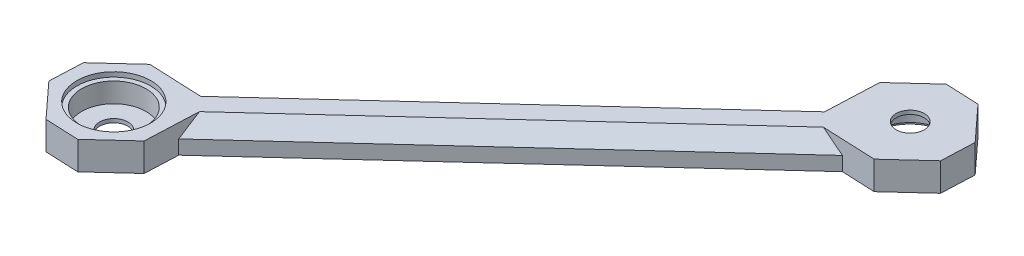
ISO-10303-21;
HEADER;
FILE_DESCRIPTION(('STEP AP214'),'2;1');
FILE_NAME('part.step','',(''),(''),'','','');
FILE_SCHEMA(('AUTOMOTIVE_DESIGN { 1 0 10303 214 1 1 1 1 }'));
ENDSEC;
DATA;
#1=APPLICATION_CONTEXT('core data for automotive mechanical design processes');
#2=APPLICATION_PROTOCOL_DEFINITION('international standard','automotive_design',2000,#1);
#3=PRODUCT_CONTEXT('',#1,'mechanical');
#4=PRODUCT('Part','Part','',(#3));
#5=PRODUCT_RELATED_PRODUCT_CATEGORY('part','',(#4));
#6=PRODUCT_DEFINITION_FORMATION('','',#4);
#7=PRODUCT_DEFINITION_CONTEXT('part definition',#1,'design');
#8=PRODUCT_DEFINITION('design','',#6,#7);
#9=PRODUCT_DEFINITION_SHAPE('','',#8);
#10=(LENGTH_UNIT() NAMED_UNIT(*) SI_UNIT(.MILLI.,.METRE.));
#11=(NAMED_UNIT(*) PLANE_ANGLE_UNIT() SI_UNIT($,.RADIAN.));
#12=(NAMED_UNIT(*) SI_UNIT($,.STERADIAN.) SOLID_ANGLE_UNIT());
#13=UNCERTAINTY_MEASURE_WITH_UNIT(LENGTH_MEASURE(1.E-05),#10,'distance_accuracy_value','');
#14=(GEOMETRIC_REPRESENTATION_CONTEXT(3) GLOBAL_UNCERTAINTY_ASSIGNED_CONTEXT((#13)) GLOBAL_UNIT_ASSIGNED_CONTEXT((#10,
#11,#12)) REPRESENTATION_CONTEXT('',''));
#15=CARTESIAN_POINT('',(0.,0.,0.));
#16=DIRECTION('',(0.,0.,1.));
#17=DIRECTION('',(1.,0.,0.));
#18=AXIS2_PLACEMENT_3D('',#15,#16,#17);
#19=CARTESIAN_POINT('',(348.939297813,-49.500004703,3.286550576));
#20=DIRECTION('',(0.,1.,0.));
#21=DIRECTION('',(1.,0.,0.));
#22=AXIS2_PLACEMENT_3D('',#19,#20,#21);
#23=PLANE('',#22);
#24=CARTESIAN_POINT('',(64.048276533,-49.500004703,44.965154128));
#25=DIRECTION('',(0.,1.,0.));
#26=DIRECTION('',(-1.,0.,0.));
#27=AXIS2_PLACEMENT_3D('',#24,#25,#26);
#28=CIRCLE('',#27,7.85);
#29=CARTESIAN_POINT('',(56.198276533,-49.500004703,44.965154128));
#30=VERTEX_POINT('',#29);
#31=CARTESIAN_POINT('',(65.680383306,-49.500004703,37.286695462));
#32=VERTEX_POINT('',#31);
#33=EDGE_CURVE('E349',#30,#32,#28,.T.);
#34=ORIENTED_EDGE('',*,*,#33,.T.);
#35=CARTESIAN_POINT('',(64.048276533,-49.500004703,44.965154128));
#36=DIRECTION('',(0.,1.,0.));
#37=DIRECTION('',(-1.,0.,0.));
#38=AXIS2_PLACEMENT_3D('',#35,#36,#37);
#39=CIRCLE('',#38,7.85);
#40=EDGE_CURVE('E322',#32,#30,#39,.T.);
#41=ORIENTED_EDGE('',*,*,#40,.T.);
#42=EDGE_LOOP('',(#34,#41));
#43=FACE_BOUND('',#42,.T.);
#44=DIRECTION('',(-0.675992147281027,0.,-0.736908825306351));
#45=VECTOR('',#44,1.);
#46=CARTESIAN_POINT('',(-28.369910029,-49.500004703,136.528677393));
#47=LINE('',#46,#45);
#48=CARTESIAN_POINT('',(-28.369910029,-49.500004703,136.528677393));
#49=VERTEX_POINT('',#48);
#50=CARTESIAN_POINT('',(-35.129831501,-49.500004703,129.159589139));
#51=VERTEX_POINT('',#50);
#52=EDGE_CURVE('E403',#49,#51,#47,.T.);
#53=ORIENTED_EDGE('',*,*,#52,.T.);
#54=DIRECTION('',(-0.0430745959942651,0.,0.999071858866984));
#55=VECTOR('',#54,1.);
#56=CARTESIAN_POINT('',(-34.82524811,-49.500004703,122.095084277));
#57=LINE('',#56,#55);
#58=CARTESIAN_POINT('',(-34.82524811,-49.500004703,122.095084277));
#59=VERTEX_POINT('',#58);
#60=EDGE_CURVE('E318',#59,#51,#57,.T.);
#61=ORIENTED_EDGE('',*,*,#60,.F.);
#62=DIRECTION('',(0.736908825306351,0.,-0.675992147281027));
#63=VECTOR('',#62,1.);
#64=CARTESIAN_POINT('',(-34.82524811,-49.500004703,122.095084277));
#65=LINE('',#64,#63);
#66=CARTESIAN_POINT('',(-27.456159857,-49.500004703,115.335162804));
#67=VERTEX_POINT('',#66);
#68=EDGE_CURVE('E278',#59,#67,#65,.T.);
#69=ORIENTED_EDGE('',*,*,#68,.T.);
#70=DIRECTION('',(-0.999071858866984,0.,-0.0430745959942651));
#71=VECTOR('',#70,1.);
#72=CARTESIAN_POINT('',(-20.391654994,-49.500004703,115.639746195));
#73=LINE('',#72,#71);
#74=CARTESIAN_POINT('',(-20.391654994,-49.500004703,115.639746195));
#75=VERTEX_POINT('',#74);
#76=EDGE_CURVE('E298',#75,#67,#73,.T.);
#77=ORIENTED_EDGE('',*,*,#76,.F.);
#78=DIRECTION('',(0.736908825306351,0.,-0.675992147281027));
#79=VECTOR('',#78,1.);
#80=CARTESIAN_POINT('',(-20.391654994,-49.500004703,115.639746195));
#81=LINE('',#80,#79);
#82=CARTESIAN_POINT('',(53.299227543,-49.500004703,48.040531474));
#83=VERTEX_POINT('',#82);
#84=EDGE_CURVE('E453',#75,#83,#81,.T.);
#85=ORIENTED_EDGE('',*,*,#84,.T.);
#86=DIRECTION('',(-0.0430745959942651,0.,0.999071858866984));
#87=VECTOR('',#86,1.);
#88=CARTESIAN_POINT('',(53.603810934,-49.500004703,40.976026611));
#89=LINE('',#88,#87);
#90=CARTESIAN_POINT('',(53.603810934,-49.500004703,40.976026611));
#91=VERTEX_POINT('',#90);
#92=EDGE_CURVE('E398',#91,#83,#89,.T.);
#93=ORIENTED_EDGE('',*,*,#92,.F.);
#94=DIRECTION('',(0.736908825306351,0.,-0.675992147281027));
#95=VECTOR('',#94,1.);
#96=CARTESIAN_POINT('',(53.603810934,-49.500004703,40.976026611));
#97=LINE('',#96,#95);
#98=CARTESIAN_POINT('',(60.972899187,-49.500004703,34.216105138));
#99=VERTEX_POINT('',#98);
#100=EDGE_CURVE('E363',#91,#99,#97,.T.);
#101=ORIENTED_EDGE('',*,*,#100,.T.);
#102=DIRECTION('',(-0.999071858866984,0.,-0.0430745959942651));
#103=VECTOR('',#102,1.);
#104=CARTESIAN_POINT('',(68.03740405,-49.500004703,34.520688529));
#105=LINE('',#104,#103);
#106=CARTESIAN_POINT('',(68.03740405,-49.500004703,34.520688529));
#107=VERTEX_POINT('',#106);
#108=EDGE_CURVE('E375',#107,#99,#105,.T.);
#109=ORIENTED_EDGE('',*,*,#108,.F.);
#110=DIRECTION('',(0.675992147281027,0.,0.736908825306351));
#111=VECTOR('',#110,1.);
#112=CARTESIAN_POINT('',(68.03740405,-49.500004703,34.520688529));
#113=LINE('',#112,#111);
#114=CARTESIAN_POINT('',(74.797325522,-49.500004703,41.889776783));
#115=VERTEX_POINT('',#114);
#116=EDGE_CURVE('E374',#107,#115,#113,.T.);
#117=ORIENTED_EDGE('',*,*,#116,.T.);
#118=DIRECTION('',(-0.0430745959942651,0.,0.999071858866984));
#119=VECTOR('',#118,1.);
#120=CARTESIAN_POINT('',(74.797325522,-49.500004703,41.889776783));
#121=LINE('',#120,#119);
#122=CARTESIAN_POINT('',(74.492742132,-49.500004703,48.954281646));
#123=VERTEX_POINT('',#122);
#124=EDGE_CURVE('E373',#115,#123,#121,.T.);
#125=ORIENTED_EDGE('',*,*,#124,.T.);
#126=DIRECTION('',(-0.736908825306351,0.,0.675992147281027));
#127=VECTOR('',#126,1.);
#128=CARTESIAN_POINT('',(74.492742132,-49.500004703,48.954281646));
#129=LINE('',#128,#127);
#130=CARTESIAN_POINT('',(67.123653878,-49.500004703,55.714203118));
#131=VERTEX_POINT('',#130);
#132=EDGE_CURVE('E422',#123,#131,#129,.T.);
#133=ORIENTED_EDGE('',*,*,#132,.T.);
#134=DIRECTION('',(-0.999071858866984,0.,-0.0430745959942651));
#135=VECTOR('',#134,1.);
#136=CARTESIAN_POINT('',(67.123653878,-49.500004703,55.714203118));
#137=LINE('',#136,#135);
#138=CARTESIAN_POINT('',(60.059149015,-49.500004703,55.409619727));
#139=VERTEX_POINT('',#138);
#140=EDGE_CURVE('E323',#131,#139,#137,.T.);
#141=ORIENTED_EDGE('',*,*,#140,.T.);
#142=DIRECTION('',(0.736908825306351,0.,-0.675992147281027));
#143=VECTOR('',#142,1.);
#144=CARTESIAN_POINT('',(-13.631733522,-49.500004703,123.008834449));
#145=LINE('',#144,#143);
#146=CARTESIAN_POINT('',(-13.631733522,-49.500004703,123.008834449));
#147=VERTEX_POINT('',#146);
#148=EDGE_CURVE('E305',#147,#139,#145,.T.);
#149=ORIENTED_EDGE('',*,*,#148,.F.);
#150=DIRECTION('',(-0.0430745959942651,0.,0.999071858866984));
#151=VECTOR('',#150,1.);
#152=CARTESIAN_POINT('',(-13.631733522,-49.500004703,123.008834449));
#153=LINE('',#152,#151);
#154=CARTESIAN_POINT('',(-13.936316912,-49.500004703,130.073339312));
#155=VERTEX_POINT('',#154);
#156=EDGE_CURVE('E300',#147,#155,#153,.T.);
#157=ORIENTED_EDGE('',*,*,#156,.T.);
#158=DIRECTION('',(0.736908825306351,0.,-0.675992147281027));
#159=VECTOR('',#158,1.);
#160=CARTESIAN_POINT('',(-21.305405166,-49.500004703,136.833260784));
#161=LINE('',#160,#159);
#162=CARTESIAN_POINT('',(-21.305405166,-49.500004703,136.833260784));
#163=VERTEX_POINT('',#162);
#164=EDGE_CURVE('E414',#163,#155,#161,.T.);
#165=ORIENTED_EDGE('',*,*,#164,.F.);
#166=DIRECTION('',(0.999071858866984,0.,0.0430745959942651));
#167=VECTOR('',#166,1.);
#168=CARTESIAN_POINT('',(-28.369910029,-49.500004703,136.528677393));
#169=LINE('',#168,#167);
#170=EDGE_CURVE('E404',#49,#163,#169,.T.);
#171=ORIENTED_EDGE('',*,*,#170,.F.);
#172=EDGE_LOOP('',(#53,#61,#69,#77,#85,#93,#101,#109,#117,#125,#133,#141,#149,#157,#165,#171));
#173=FACE_BOUND('',#172,.T.);
#174=CARTESIAN_POINT('',(-24.380782511,-49.500004703,126.084211794));
#175=DIRECTION('',(0.,1.,0.));
#176=DIRECTION('',(-0.207911690937987,0.,0.97814760070825));
#177=AXIS2_PLACEMENT_3D('',#174,#175,#176);
#178=CIRCLE('',#177,3.);
#179=CARTESIAN_POINT('',(-25.004517584,-49.500004703,129.018654596));
#180=VERTEX_POINT('',#179);
#181=CARTESIAN_POINT('',(-23.757047439,-49.500004703,123.149768992));
#182=VERTEX_POINT('',#181);
#183=EDGE_CURVE('E27',#180,#182,#178,.T.);
#184=ORIENTED_EDGE('',*,*,#183,.T.);
#185=CARTESIAN_POINT('',(-24.380782511,-49.500004703,126.084211794));
#186=DIRECTION('',(0.,1.,0.));
#187=DIRECTION('',(-0.207911690937987,0.,0.97814760070825));
#188=AXIS2_PLACEMENT_3D('',#185,#186,#187);
#189=CIRCLE('',#188,3.);
#190=EDGE_CURVE('E11',#182,#180,#189,.T.);
#191=ORIENTED_EDGE('',*,*,#190,.T.);
#192=EDGE_LOOP('',(#184,#191));
#193=FACE_BOUND('',#192,.T.);
#194=ADVANCED_FACE('F16',(#43,#173,#193),#23,.F.);
#195=CARTESIAN_POINT('',(-24.380782511,-47.500004703,126.084211794));
#196=DIRECTION('',(0.,-1.,0.));
#197=DIRECTION('',(0.207911690937987,0.,-0.97814760070825));
#198=AXIS2_PLACEMENT_3D('',#195,#196,#197);
#199=CYLINDRICAL_SURFACE('',#198,3.);
#200=DIRECTION('',(0.,1.,0.));
#201=VECTOR('',#200,1.);
#202=CARTESIAN_POINT('',(-23.757047439,-49.500004703,123.149768992));
#203=LINE('',#202,#201);
#204=CARTESIAN_POINT('',(-23.757047439,-48.700004703,123.149768992));
#205=VERTEX_POINT('',#204);
#206=EDGE_CURVE('E310',#182,#205,#203,.T.);
#207=ORIENTED_EDGE('',*,*,#206,.F.);
#208=ORIENTED_EDGE('',*,*,#183,.F.);
#209=ORIENTED_EDGE('',*,*,#190,.F.);
#210=ORIENTED_EDGE('',*,*,#206,.T.);
#211=CARTESIAN_POINT('',(-24.380782511,-48.700004703,126.084211794));
#212=DIRECTION('',(0.,1.,0.));
#213=DIRECTION('',(-0.207911690937987,0.,0.97814760070825));
#214=AXIS2_PLACEMENT_3D('',#211,#212,#213);
#215=CIRCLE('',#214,3.);
#216=CARTESIAN_POINT('',(-25.004517584,-48.700004703,129.018654596));
#217=VERTEX_POINT('',#216);
#218=EDGE_CURVE('E311',#205,#217,#215,.T.);
#219=ORIENTED_EDGE('',*,*,#218,.T.);
#220=CARTESIAN_POINT('',(-24.380782511,-48.700004703,126.084211794));
#221=DIRECTION('',(0.,1.,0.));
#222=DIRECTION('',(-0.207911690937987,0.,0.97814760070825));
#223=AXIS2_PLACEMENT_3D('',#220,#221,#222);
#224=CIRCLE('',#223,3.);
#225=EDGE_CURVE('E306',#217,#205,#224,.T.);
#226=ORIENTED_EDGE('',*,*,#225,.T.);
#227=EDGE_LOOP('',(#207,#208,#209,#210,#219,#226));
#228=FACE_BOUND('',#227,.T.);
#229=ADVANCED_FACE('F948',(#228),#199,.F.);
#230=CARTESIAN_POINT('',(260.510238769,-48.700004703,84.405608242));
#231=DIRECTION('',(0.,1.,0.));
#232=DIRECTION('',(1.,0.,0.));
#233=AXIS2_PLACEMENT_3D('',#230,#231,#232);
#234=PLANE('',#233);
#235=CARTESIAN_POINT('',(-24.380782511,-48.700004703,126.084211794));
#236=DIRECTION('',(0.,-1.,0.));
#237=DIRECTION('',(-1.,0.,0.));
#238=AXIS2_PLACEMENT_3D('',#235,#236,#237);
#239=CIRCLE('',#238,6.85);
#240=CARTESIAN_POINT('',(-22.956587429,-48.700004703,119.383900729));
#241=VERTEX_POINT('',#240);
#242=CARTESIAN_POINT('',(-31.230782511,-48.700004703,126.084211794));
#243=VERTEX_POINT('',#242);
#244=EDGE_CURVE('E426',#241,#243,#239,.T.);
#245=ORIENTED_EDGE('',*,*,#244,.F.);
#246=CARTESIAN_POINT('',(-24.380782511,-48.700004703,126.084211794));
#247=DIRECTION('',(0.,-1.,0.));
#248=DIRECTION('',(-1.,0.,0.));
#249=AXIS2_PLACEMENT_3D('',#246,#247,#248);
#250=CIRCLE('',#249,6.85);
#251=EDGE_CURVE('E423',#243,#241,#250,.T.);
#252=ORIENTED_EDGE('',*,*,#251,.F.);
#253=EDGE_LOOP('',(#245,#252));
#254=FACE_BOUND('',#253,.T.);
#255=ORIENTED_EDGE('',*,*,#218,.F.);
#256=ORIENTED_EDGE('',*,*,#225,.F.);
#257=EDGE_LOOP('',(#255,#256));
#258=FACE_BOUND('',#257,.T.);
#259=ADVANCED_FACE('F932',(#254,#258),#234,.T.);
#260=CARTESIAN_POINT('',(-24.380782511,-44.500004703,126.084211794));
#261=DIRECTION('',(0.,-1.,0.));
#262=DIRECTION('',(0.207911690937987,0.,-0.97814760070825));
#263=AXIS2_PLACEMENT_3D('',#260,#261,#262);
#264=CYLINDRICAL_SURFACE('',#263,6.85);
#265=DIRECTION('',(0.,1.,0.));
#266=VECTOR('',#265,1.);
#267=CARTESIAN_POINT('',(-22.956587429,-48.700004703,119.383900729));
#268=LINE('',#267,#266);
#269=CARTESIAN_POINT('',(-22.956587429,-44.500004703,119.383900729));
#270=VERTEX_POINT('',#269);
#271=EDGE_CURVE('E443',#241,#270,#268,.T.);
#272=ORIENTED_EDGE('',*,*,#271,.F.);
#273=ORIENTED_EDGE('',*,*,#244,.T.);
#274=ORIENTED_EDGE('',*,*,#251,.T.);
#275=ORIENTED_EDGE('',*,*,#271,.T.);
#276=CARTESIAN_POINT('',(-24.380782511,-44.500004703,126.084211794));
#277=DIRECTION('',(0.,1.,0.));
#278=DIRECTION('',(-1.,0.,0.));
#279=AXIS2_PLACEMENT_3D('',#276,#277,#278);
#280=CIRCLE('',#279,6.85);
#281=CARTESIAN_POINT('',(-31.230782511,-44.500004703,126.084211794));
#282=VERTEX_POINT('',#281);
#283=EDGE_CURVE('E448',#270,#282,#280,.T.);
#284=ORIENTED_EDGE('',*,*,#283,.T.);
#285=CARTESIAN_POINT('',(-24.380782511,-44.500004703,126.084211794));
#286=DIRECTION('',(0.,1.,0.));
#287=DIRECTION('',(-1.,0.,0.));
#288=AXIS2_PLACEMENT_3D('',#285,#286,#287);
#289=CIRCLE('',#288,6.85);
#290=EDGE_CURVE('E444',#282,#270,#289,.T.);
#291=ORIENTED_EDGE('',*,*,#290,.T.);
#292=EDGE_LOOP('',(#272,#273,#274,#275,#284,#291));
#293=FACE_BOUND('',#292,.T.);
#294=ADVANCED_FACE('F928',(#293),#264,.F.);
#295=CARTESIAN_POINT('',(260.510238769,-44.500004703,84.405608242));
#296=DIRECTION('',(0.,1.,0.));
#297=DIRECTION('',(1.,0.,0.));
#298=AXIS2_PLACEMENT_3D('',#295,#296,#297);
#299=PLANE('',#298);
#300=CARTESIAN_POINT('',(-24.380782511,-44.500004703,126.084211794));
#301=DIRECTION('',(0.,-1.,0.));
#302=DIRECTION('',(-1.,0.,0.));
#303=AXIS2_PLACEMENT_3D('',#300,#301,#302);
#304=CIRCLE('',#303,7.85);
#305=CARTESIAN_POINT('',(-22.748675738,-44.500004703,118.405753128));
#306=VERTEX_POINT('',#305);
#307=CARTESIAN_POINT('',(-32.230782511,-44.500004703,126.084211794));
#308=VERTEX_POINT('',#307);
#309=EDGE_CURVE('E275',#306,#308,#304,.T.);
#310=ORIENTED_EDGE('',*,*,#309,.F.);
#311=CARTESIAN_POINT('',(-24.380782511,-44.500004703,126.084211794));
#312=DIRECTION('',(0.,-1.,0.));
#313=DIRECTION('',(-1.,0.,0.));
#314=AXIS2_PLACEMENT_3D('',#311,#312,#313);
#315=CIRCLE('',#314,7.85);
#316=EDGE_CURVE('E268',#308,#306,#315,.T.);
#317=ORIENTED_EDGE('',*,*,#316,.F.);
#318=EDGE_LOOP('',(#310,#317));
#319=FACE_BOUND('',#318,.T.);
#320=ORIENTED_EDGE('',*,*,#283,.F.);
#321=ORIENTED_EDGE('',*,*,#290,.F.);
#322=EDGE_LOOP('',(#320,#321));
#323=FACE_BOUND('',#322,.T.);
#324=ADVANCED_FACE('F280',(#319,#323),#299,.T.);
#325=CARTESIAN_POINT('',(-33.439851133,-43.500004703,131.001861203));
#326=DIRECTION('',(-0.736908825306351,0.,0.675992147281027));
#327=DIRECTION('',(0.,1.,0.));
#328=AXIS2_PLACEMENT_3D('',#325,#326,#327);
#329=PLANE('',#328);
#330=ORIENTED_EDGE('',*,*,#52,.F.);
#331=DIRECTION('',(0.,-1.,0.));
#332=VECTOR('',#331,1.);
#333=CARTESIAN_POINT('',(-28.369910029,-43.500004703,136.528677393));
#334=LINE('',#333,#332);
#335=CARTESIAN_POINT('',(-28.369910029,-43.500004703,136.528677393));
#336=VERTEX_POINT('',#335);
#337=EDGE_CURVE('E399',#336,#49,#334,.T.);
#338=ORIENTED_EDGE('',*,*,#337,.F.);
#339=DIRECTION('',(-0.675992147281027,0.,-0.736908825306351));
#340=VECTOR('',#339,1.);
#341=CARTESIAN_POINT('',(-28.369910029,-43.500004703,136.528677393));
#342=LINE('',#341,#340);
#343=CARTESIAN_POINT('',(-35.129831501,-43.500004703,129.159589139));
#344=VERTEX_POINT('',#343);
#345=EDGE_CURVE('E408',#336,#344,#342,.T.);
#346=ORIENTED_EDGE('',*,*,#345,.T.);
#347=DIRECTION('',(0.,-1.,0.));
#348=VECTOR('',#347,1.);
#349=CARTESIAN_POINT('',(-35.129831501,-43.500004703,129.159589139));
#350=LINE('',#349,#348);
#351=EDGE_CURVE('E294',#344,#51,#350,.T.);
#352=ORIENTED_EDGE('',*,*,#351,.T.);
#353=EDGE_LOOP('',(#330,#338,#346,#352));
#354=FACE_BOUND('',#353,.T.);
#355=ADVANCED_FACE('F647',(#354),#329,.T.);
#356=CARTESIAN_POINT('',(-24.837657597,-43.500004703,136.680969088));
#357=DIRECTION('',(0.043074595994265,0.,-0.999071858866984));
#358=DIRECTION('',(0.,-1.,0.));
#359=AXIS2_PLACEMENT_3D('',#356,#357,#358);
#360=PLANE('',#359);
#361=ORIENTED_EDGE('',*,*,#170,.T.);
#362=DIRECTION('',(0.,-1.,0.));
#363=VECTOR('',#362,1.);
#364=CARTESIAN_POINT('',(-21.305405166,-43.500004703,136.833260784));
#365=LINE('',#364,#363);
#366=CARTESIAN_POINT('',(-21.305405166,-43.500004703,136.833260784));
#367=VERTEX_POINT('',#366);
#368=EDGE_CURVE('E417',#367,#163,#365,.T.);
#369=ORIENTED_EDGE('',*,*,#368,.F.);
#370=DIRECTION('',(0.999071858866984,0.,0.0430745959942651));
#371=VECTOR('',#370,1.);
#372=CARTESIAN_POINT('',(-28.369910029,-43.500004703,136.528677393));
#373=LINE('',#372,#371);
#374=EDGE_CURVE('E340',#336,#367,#373,.T.);
#375=ORIENTED_EDGE('',*,*,#374,.F.);
#376=ORIENTED_EDGE('',*,*,#337,.T.);
#377=EDGE_LOOP('',(#361,#369,#375,#376));
#378=FACE_BOUND('',#377,.T.);
#379=ADVANCED_FACE('F642',(#378),#360,.F.);
#380=CARTESIAN_POINT('',(16.514885974,-43.500004703,102.139389661));
#381=DIRECTION('',(-0.675992147281027,0.,-0.736908825306351));
#382=DIRECTION('',(-0.736908825306351,0.,0.675992147281027));
#383=AXIS2_PLACEMENT_3D('',#380,#381,#382);
#384=PLANE('',#383);
#385=ORIENTED_EDGE('',*,*,#164,.T.);
#386=DIRECTION('',(0.,-1.,0.));
#387=VECTOR('',#386,1.);
#388=CARTESIAN_POINT('',(-13.936316912,-43.500004703,130.073339312));
#389=LINE('',#388,#387);
#390=CARTESIAN_POINT('',(-13.936316912,-43.500004703,130.073339312));
#391=VERTEX_POINT('',#390);
#392=EDGE_CURVE('E304',#391,#155,#389,.T.);
#393=ORIENTED_EDGE('',*,*,#392,.F.);
#394=DIRECTION('',(0.736908825306351,0.,-0.675992147281027));
#395=VECTOR('',#394,1.);
#396=CARTESIAN_POINT('',(-21.305405166,-43.500004703,136.833260784));
#397=LINE('',#396,#395);
#398=EDGE_CURVE('E335',#367,#391,#397,.T.);
#399=ORIENTED_EDGE('',*,*,#398,.F.);
#400=ORIENTED_EDGE('',*,*,#368,.T.);
#401=EDGE_LOOP('',(#385,#393,#399,#400));
#402=FACE_BOUND('',#401,.T.);
#403=ADVANCED_FACE('F639',(#402),#384,.F.);
#404=CARTESIAN_POINT('',(-13.784025217,-43.500004703,126.54108688));
#405=DIRECTION('',(0.999071858866984,0.,0.043074595994265));
#406=DIRECTION('',(0.,-1.,0.));
#407=AXIS2_PLACEMENT_3D('',#404,#405,#406);
#408=PLANE('',#407);
#409=ORIENTED_EDGE('',*,*,#156,.F.);
#410=DIRECTION('',(0.,-1.,0.));
#411=VECTOR('',#410,1.);
#412=CARTESIAN_POINT('',(-13.631733522,-46.500004703,123.008834449));
#413=LINE('',#412,#411);
#414=CARTESIAN_POINT('',(-13.631733522,-46.500004703,123.008834449));
#415=VERTEX_POINT('',#414);
#416=EDGE_CURVE('E519',#415,#147,#413,.T.);
#417=ORIENTED_EDGE('',*,*,#416,.F.);
#418=DIRECTION('',(0.0351702609992071,0.577350268986985,-0.815738756981611));
#419=VECTOR('',#418,1.);
#420=CARTESIAN_POINT('',(-13.631733522,-46.500004703,123.008834449));
#421=LINE('',#420,#419);
#422=CARTESIAN_POINT('',(-13.448983487,-43.500004703,118.770131531));
#423=VERTEX_POINT('',#422);
#424=EDGE_CURVE('E350',#415,#423,#421,.T.);
#425=ORIENTED_EDGE('',*,*,#424,.T.);
#426=DIRECTION('',(-0.043074595994265,0.,0.999071858866984));
#427=VECTOR('',#426,1.);
#428=CARTESIAN_POINT('',(-13.448983487,-43.500004703,118.770131531));
#429=LINE('',#428,#427);
#430=EDGE_CURVE('E339',#423,#391,#429,.T.);
#431=ORIENTED_EDGE('',*,*,#430,.T.);
#432=ORIENTED_EDGE('',*,*,#392,.T.);
#433=EDGE_LOOP('',(#409,#417,#425,#431,#432));
#434=FACE_BOUND('',#433,.T.);
#435=ADVANCED_FACE('F636',(#434),#408,.T.);
#436=CARTESIAN_POINT('',(13.915930872,-43.500004703,97.738401848));
#437=DIRECTION('',(-0.675992147281027,0.,-0.736908825306351));
#438=DIRECTION('',(-0.736908825306351,0.,0.675992147281027));
#439=AXIS2_PLACEMENT_3D('',#436,#437,#438);
#440=PLANE('',#439);
#441=DIRECTION('',(0.,-1.,0.));
#442=VECTOR('',#441,1.);
#443=CARTESIAN_POINT('',(60.059149015,-46.500004703,55.409619727));
#444=LINE('',#443,#442);
#445=CARTESIAN_POINT('',(60.059149015,-46.500004703,55.409619727));
#446=VERTEX_POINT('',#445);
#447=EDGE_CURVE('E327',#446,#139,#444,.T.);
#448=ORIENTED_EDGE('',*,*,#447,.F.);
#449=DIRECTION('',(-0.736908825306351,0.,0.675992147281027));
#450=VECTOR('',#449,1.);
#451=CARTESIAN_POINT('',(60.059149015,-46.500004703,55.409619727));
#452=LINE('',#451,#450);
#453=EDGE_CURVE('E353',#446,#415,#452,.T.);
#454=ORIENTED_EDGE('',*,*,#453,.T.);
#455=ORIENTED_EDGE('',*,*,#416,.T.);
#456=ORIENTED_EDGE('',*,*,#148,.T.);
#457=EDGE_LOOP('',(#448,#454,#455,#456));
#458=FACE_BOUND('',#457,.T.);
#459=ADVANCED_FACE('F589',(#458),#440,.F.);
#460=CARTESIAN_POINT('',(63.591401446,-43.500004703,55.561911423));
#461=DIRECTION('',(-0.043074595994265,0.,0.999071858866984));
#462=DIRECTION('',(0.,1.,0.));
#463=AXIS2_PLACEMENT_3D('',#460,#461,#462);
#464=PLANE('',#463);
#465=ORIENTED_EDGE('',*,*,#140,.F.);
#466=DIRECTION('',(0.,-1.,0.));
#467=VECTOR('',#466,1.);
#468=CARTESIAN_POINT('',(67.123653878,-43.500004703,55.714203118));
#469=LINE('',#468,#467);
#470=CARTESIAN_POINT('',(67.123653878,-43.500004703,55.714203118));
#471=VERTEX_POINT('',#470);
#472=EDGE_CURVE('E328',#471,#131,#469,.T.);
#473=ORIENTED_EDGE('',*,*,#472,.F.);
#474=DIRECTION('',(-0.999071858866984,0.,-0.043074595994265));
#475=VECTOR('',#474,1.);
#476=CARTESIAN_POINT('',(67.123653878,-43.500004703,55.714203118));
#477=LINE('',#476,#475);
#478=CARTESIAN_POINT('',(55.820446097,-43.500004703,55.226869693));
#479=VERTEX_POINT('',#478);
#480=EDGE_CURVE('E391',#471,#479,#477,.T.);
#481=ORIENTED_EDGE('',*,*,#480,.T.);
#482=DIRECTION('',(0.815738756981611,-0.577350268986985,0.0351702609992071));
#483=VECTOR('',#482,1.);
#484=CARTESIAN_POINT('',(55.820446097,-43.500004703,55.226869693));
#485=LINE('',#484,#483);
#486=EDGE_CURVE('E465',#479,#446,#485,.T.);
#487=ORIENTED_EDGE('',*,*,#486,.T.);
#488=ORIENTED_EDGE('',*,*,#447,.T.);
#489=EDGE_LOOP('',(#465,#473,#481,#487,#488));
#490=FACE_BOUND('',#489,.T.);
#491=ADVANCED_FACE('F585',(#490),#464,.T.);
#492=CARTESIAN_POINT('',(68.965925941,-43.500004703,54.02422275));
#493=DIRECTION('',(0.675992147281027,0.,0.736908825306351));
#494=DIRECTION('',(0.,-1.,0.));
#495=AXIS2_PLACEMENT_3D('',#492,#493,#494);
#496=PLANE('',#495);
#497=ORIENTED_EDGE('',*,*,#132,.F.);
#498=DIRECTION('',(0.,-1.,0.));
#499=VECTOR('',#498,1.);
#500=CARTESIAN_POINT('',(74.492742132,-43.500004703,48.954281646));
#501=LINE('',#500,#499);
#502=CARTESIAN_POINT('',(74.492742132,-43.500004703,48.954281646));
#503=VERTEX_POINT('',#502);
#504=EDGE_CURVE('E418',#503,#123,#501,.T.);
#505=ORIENTED_EDGE('',*,*,#504,.F.);
#506=DIRECTION('',(-0.736908825306351,0.,0.675992147281027));
#507=VECTOR('',#506,1.);
#508=CARTESIAN_POINT('',(74.492742132,-43.500004703,48.954281646));
#509=LINE('',#508,#507);
#510=EDGE_CURVE('E386',#503,#471,#509,.T.);
#511=ORIENTED_EDGE('',*,*,#510,.T.);
#512=ORIENTED_EDGE('',*,*,#472,.T.);
#513=EDGE_LOOP('',(#497,#505,#511,#512));
#514=FACE_BOUND('',#513,.T.);
#515=ADVANCED_FACE('F571',(#514),#496,.T.);
#516=CARTESIAN_POINT('',(74.645033827,-43.500004703,45.422029214));
#517=DIRECTION('',(0.999071858866984,0.,0.043074595994265));
#518=DIRECTION('',(0.,-1.,0.));
#519=AXIS2_PLACEMENT_3D('',#516,#517,#518);
#520=PLANE('',#519);
#521=ORIENTED_EDGE('',*,*,#124,.F.);
#522=DIRECTION('',(0.,-1.,0.));
#523=VECTOR('',#522,1.);
#524=CARTESIAN_POINT('',(74.797325522,-43.500004703,41.889776783));
#525=LINE('',#524,#523);
#526=CARTESIAN_POINT('',(74.797325522,-43.500004703,41.889776783));
#527=VERTEX_POINT('',#526);
#528=EDGE_CURVE('E369',#527,#115,#525,.T.);
#529=ORIENTED_EDGE('',*,*,#528,.F.);
#530=DIRECTION('',(-0.0430745959942651,0.,0.999071858866984));
#531=VECTOR('',#530,1.);
#532=CARTESIAN_POINT('',(74.797325522,-43.500004703,41.889776783));
#533=LINE('',#532,#531);
#534=EDGE_CURVE('E390',#527,#503,#533,.T.);
#535=ORIENTED_EDGE('',*,*,#534,.T.);
#536=ORIENTED_EDGE('',*,*,#504,.T.);
#537=EDGE_LOOP('',(#521,#529,#535,#536));
#538=FACE_BOUND('',#537,.T.);
#539=ADVANCED_FACE('F573',(#538),#520,.T.);
#540=CARTESIAN_POINT('',(73.107345154,-43.500004703,40.047504719));
#541=DIRECTION('',(0.736908825306351,0.,-0.675992147281027));
#542=DIRECTION('',(0.,-1.,0.));
#543=AXIS2_PLACEMENT_3D('',#540,#541,#542);
#544=PLANE('',#543);
#545=ORIENTED_EDGE('',*,*,#116,.F.);
#546=DIRECTION('',(0.,-1.,0.));
#547=VECTOR('',#546,1.);
#548=CARTESIAN_POINT('',(68.03740405,-43.500004703,34.520688529));
#549=LINE('',#548,#547);
#550=CARTESIAN_POINT('',(68.03740405,-43.500004703,34.520688529));
#551=VERTEX_POINT('',#550);
#552=EDGE_CURVE('E378',#551,#107,#549,.T.);
#553=ORIENTED_EDGE('',*,*,#552,.F.);
#554=DIRECTION('',(0.675992147281027,0.,0.736908825306351));
#555=VECTOR('',#554,1.);
#556=CARTESIAN_POINT('',(68.03740405,-43.500004703,34.520688529));
#557=LINE('',#556,#555);
#558=EDGE_CURVE('E439',#551,#527,#557,.T.);
#559=ORIENTED_EDGE('',*,*,#558,.T.);
#560=ORIENTED_EDGE('',*,*,#528,.T.);
#561=EDGE_LOOP('',(#545,#553,#559,#560));
#562=FACE_BOUND('',#561,.T.);
#563=ADVANCED_FACE('F18',(#562),#544,.T.);
#564=CARTESIAN_POINT('',(64.505151619,-43.500004703,34.368396834));
#565=DIRECTION('',(-0.043074595994265,0.,0.999071858866984));
#566=DIRECTION('',(0.,1.,0.));
#567=AXIS2_PLACEMENT_3D('',#564,#565,#566);
#568=PLANE('',#567);
#569=ORIENTED_EDGE('',*,*,#108,.T.);
#570=DIRECTION('',(0.,-1.,0.));
#571=VECTOR('',#570,1.);
#572=CARTESIAN_POINT('',(60.972899187,-43.500004703,34.216105138));
#573=LINE('',#572,#571);
#574=CARTESIAN_POINT('',(60.972899187,-43.500004703,34.216105138));
#575=VERTEX_POINT('',#574);
#576=EDGE_CURVE('E367',#575,#99,#573,.T.);
#577=ORIENTED_EDGE('',*,*,#576,.F.);
#578=DIRECTION('',(-0.999071858866984,0.,-0.0430745959942651));
#579=VECTOR('',#578,1.);
#580=CARTESIAN_POINT('',(68.03740405,-43.500004703,34.520688529));
#581=LINE('',#580,#579);
#582=EDGE_CURVE('E333',#551,#575,#581,.T.);
#583=ORIENTED_EDGE('',*,*,#582,.F.);
#584=ORIENTED_EDGE('',*,*,#552,.T.);
#585=EDGE_LOOP('',(#569,#577,#583,#584));
#586=FACE_BOUND('',#585,.T.);
#587=ADVANCED_FACE('F893',(#586),#568,.F.);
#588=CARTESIAN_POINT('',(59.130627124,-43.500004703,35.906085507));
#589=DIRECTION('',(-0.675992147281027,0.,-0.736908825306351));
#590=DIRECTION('',(-0.736908825306351,0.,0.675992147281027));
#591=AXIS2_PLACEMENT_3D('',#588,#589,#590);
#592=PLANE('',#591);
#593=ORIENTED_EDGE('',*,*,#100,.F.);
#594=DIRECTION('',(0.,-1.,0.));
#595=VECTOR('',#594,1.);
#596=CARTESIAN_POINT('',(53.603810934,-43.500004703,40.976026611));
#597=LINE('',#596,#595);
#598=CARTESIAN_POINT('',(53.603810934,-43.500004703,40.976026611));
#599=VERTEX_POINT('',#598);
#600=EDGE_CURVE('E368',#599,#91,#597,.T.);
#601=ORIENTED_EDGE('',*,*,#600,.F.);
#602=DIRECTION('',(0.736908825306351,0.,-0.675992147281027));
#603=VECTOR('',#602,1.);
#604=CARTESIAN_POINT('',(53.603810934,-43.500004703,40.976026611));
#605=LINE('',#604,#603);
#606=EDGE_CURVE('E329',#599,#575,#605,.T.);
#607=ORIENTED_EDGE('',*,*,#606,.T.);
#608=ORIENTED_EDGE('',*,*,#576,.T.);
#609=EDGE_LOOP('',(#593,#601,#607,#608));
#610=FACE_BOUND('',#609,.T.);
#611=ADVANCED_FACE('F897',(#610),#592,.T.);
#612=CARTESIAN_POINT('',(53.451519238,-43.500004703,44.508279042));
#613=DIRECTION('',(0.999071858866984,0.,0.043074595994265));
#614=DIRECTION('',(0.,-1.,0.));
#615=AXIS2_PLACEMENT_3D('',#612,#613,#614);
#616=PLANE('',#615);
#617=ORIENTED_EDGE('',*,*,#92,.T.);
#618=DIRECTION('',(0.,-1.,0.));
#619=VECTOR('',#618,1.);
#620=CARTESIAN_POINT('',(53.299227543,-46.500004703,48.040531474));
#621=LINE('',#620,#619);
#622=CARTESIAN_POINT('',(53.299227543,-46.500004703,48.040531474));
#623=VERTEX_POINT('',#622);
#624=EDGE_CURVE('E449',#623,#83,#621,.T.);
#625=ORIENTED_EDGE('',*,*,#624,.F.);
#626=DIRECTION('',(-0.0351702609992071,0.577350268986985,0.815738756981611));
#627=VECTOR('',#626,1.);
#628=CARTESIAN_POINT('',(53.299227543,-46.500004703,48.040531474));
#629=LINE('',#628,#627);
#630=CARTESIAN_POINT('',(53.116477508,-43.500004703,52.279234391));
#631=VERTEX_POINT('',#630);
#632=EDGE_CURVE('E346',#623,#631,#629,.T.);
#633=ORIENTED_EDGE('',*,*,#632,.T.);
#634=DIRECTION('',(-0.043074595994265,0.,0.999071858866984));
#635=VECTOR('',#634,1.);
#636=CARTESIAN_POINT('',(53.603810934,-43.500004703,40.976026611));
#637=LINE('',#636,#635);
#638=EDGE_CURVE('E495',#599,#631,#637,.T.);
#639=ORIENTED_EDGE('',*,*,#638,.F.);
#640=ORIENTED_EDGE('',*,*,#600,.T.);
#641=EDGE_LOOP('',(#617,#625,#633,#639,#640));
#642=FACE_BOUND('',#641,.T.);
#643=ADVANCED_FACE('F970',(#642),#616,.F.);
#644=CARTESIAN_POINT('',(16.453786275,-43.500004703,81.840138834));
#645=DIRECTION('',(-0.675992147281027,0.,-0.736908825306351));
#646=DIRECTION('',(-0.736908825306351,0.,0.675992147281027));
#647=AXIS2_PLACEMENT_3D('',#644,#645,#646);
#648=PLANE('',#647);
#649=DIRECTION('',(0.,-1.,0.));
#650=VECTOR('',#649,1.);
#651=CARTESIAN_POINT('',(-20.391654994,-46.500004703,115.639746195));
#652=LINE('',#651,#650);
#653=CARTESIAN_POINT('',(-20.391654994,-46.500004703,115.639746195));
#654=VERTEX_POINT('',#653);
#655=EDGE_CURVE('E454',#654,#75,#652,.T.);
#656=ORIENTED_EDGE('',*,*,#655,.F.);
#657=DIRECTION('',(0.736908825306351,0.,-0.675992147281027));
#658=VECTOR('',#657,1.);
#659=CARTESIAN_POINT('',(-20.391654994,-46.500004703,115.639746195));
#660=LINE('',#659,#658);
#661=EDGE_CURVE('E341',#654,#623,#660,.T.);
#662=ORIENTED_EDGE('',*,*,#661,.T.);
#663=ORIENTED_EDGE('',*,*,#624,.T.);
#664=ORIENTED_EDGE('',*,*,#84,.F.);
#665=EDGE_LOOP('',(#656,#662,#663,#664));
#666=FACE_BOUND('',#665,.T.);
#667=ADVANCED_FACE('F966',(#666),#648,.T.);
#668=CARTESIAN_POINT('',(-23.923907425,-43.500004703,115.4874545));
#669=DIRECTION('',(-0.043074595994265,0.,0.999071858866984));
#670=DIRECTION('',(0.,1.,0.));
#671=AXIS2_PLACEMENT_3D('',#668,#669,#670);
#672=PLANE('',#671);
#673=ORIENTED_EDGE('',*,*,#76,.T.);
#674=DIRECTION('',(0.,-1.,0.));
#675=VECTOR('',#674,1.);
#676=CARTESIAN_POINT('',(-27.456159857,-43.500004703,115.335162804));
#677=LINE('',#676,#675);
#678=CARTESIAN_POINT('',(-27.456159857,-43.500004703,115.335162804));
#679=VERTEX_POINT('',#678);
#680=EDGE_CURVE('E532',#679,#67,#677,.T.);
#681=ORIENTED_EDGE('',*,*,#680,.F.);
#682=DIRECTION('',(-0.999071858866984,0.,-0.043074595994265));
#683=VECTOR('',#682,1.);
#684=CARTESIAN_POINT('',(-16.152952076,-43.500004703,115.82249623));
#685=LINE('',#684,#683);
#686=CARTESIAN_POINT('',(-16.152952076,-43.500004703,115.82249623));
#687=VERTEX_POINT('',#686);
#688=EDGE_CURVE('E317',#687,#679,#685,.T.);
#689=ORIENTED_EDGE('',*,*,#688,.F.);
#690=DIRECTION('',(-0.815738756981611,-0.577350268986985,-0.0351702609992071));
#691=VECTOR('',#690,1.);
#692=CARTESIAN_POINT('',(-16.152952076,-43.500004703,115.82249623));
#693=LINE('',#692,#691);
#694=EDGE_CURVE('E469',#687,#654,#693,.T.);
#695=ORIENTED_EDGE('',*,*,#694,.T.);
#696=ORIENTED_EDGE('',*,*,#655,.T.);
#697=EDGE_LOOP('',(#673,#681,#689,#695,#696));
#698=FACE_BOUND('',#697,.T.);
#699=ADVANCED_FACE('F885',(#698),#672,.F.);
#700=CARTESIAN_POINT('',(5.135598585,-43.500004703,85.437606944));
#701=DIRECTION('',(-0.675992147281027,0.,-0.736908825306351));
#702=DIRECTION('',(-0.736908825306351,0.,0.675992147281027));
#703=AXIS2_PLACEMENT_3D('',#700,#701,#702);
#704=PLANE('',#703);
#705=ORIENTED_EDGE('',*,*,#68,.F.);
#706=DIRECTION('',(0.,-1.,0.));
#707=VECTOR('',#706,1.);
#708=CARTESIAN_POINT('',(-34.82524811,-43.500004703,122.095084277));
#709=LINE('',#708,#707);
#710=CARTESIAN_POINT('',(-34.82524811,-43.500004703,122.095084277));
#711=VERTEX_POINT('',#710);
#712=EDGE_CURVE('E287',#711,#59,#709,.T.);
#713=ORIENTED_EDGE('',*,*,#712,.F.);
#714=DIRECTION('',(0.736908825306351,0.,-0.675992147281027));
#715=VECTOR('',#714,1.);
#716=CARTESIAN_POINT('',(-34.82524811,-43.500004703,122.095084277));
#717=LINE('',#716,#715);
#718=EDGE_CURVE('E312',#711,#679,#717,.T.);
#719=ORIENTED_EDGE('',*,*,#718,.T.);
#720=ORIENTED_EDGE('',*,*,#680,.T.);
#721=EDGE_LOOP('',(#705,#713,#719,#720));
#722=FACE_BOUND('',#721,.T.);
#723=ADVANCED_FACE('F654',(#722),#704,.T.);
#724=CARTESIAN_POINT('',(-24.380782511,-43.500004703,126.084211794));
#725=DIRECTION('',(0.,-1.,0.));
#726=DIRECTION('',(0.207911690937987,0.,-0.97814760070825));
#727=AXIS2_PLACEMENT_3D('',#724,#725,#726);
#728=CYLINDRICAL_SURFACE('',#727,7.85);
#729=DIRECTION('',(0.,1.,0.));
#730=VECTOR('',#729,1.);
#731=CARTESIAN_POINT('',(-22.748675738,-44.500004703,118.405753128));
#732=LINE('',#731,#730);
#733=CARTESIAN_POINT('',(-22.748675738,-43.500004703,118.405753128));
#734=VERTEX_POINT('',#733);
#735=EDGE_CURVE('E273',#306,#734,#732,.T.);
#736=ORIENTED_EDGE('',*,*,#735,.F.);
#737=ORIENTED_EDGE('',*,*,#309,.T.);
#738=ORIENTED_EDGE('',*,*,#316,.T.);
#739=ORIENTED_EDGE('',*,*,#735,.T.);
#740=CARTESIAN_POINT('',(-24.380782511,-43.500004703,126.084211794));
#741=DIRECTION('',(0.,1.,0.));
#742=DIRECTION('',(-1.,0.,0.));
#743=AXIS2_PLACEMENT_3D('',#740,#741,#742);
#744=CIRCLE('',#743,7.85);
#745=CARTESIAN_POINT('',(-32.230782511,-43.500004703,126.084211794));
#746=VERTEX_POINT('',#745);
#747=EDGE_CURVE('E332',#734,#746,#744,.T.);
#748=ORIENTED_EDGE('',*,*,#747,.T.);
#749=CARTESIAN_POINT('',(-24.380782511,-43.500004703,126.084211794));
#750=DIRECTION('',(0.,1.,0.));
#751=DIRECTION('',(-1.,0.,0.));
#752=AXIS2_PLACEMENT_3D('',#749,#750,#751);
#753=CIRCLE('',#752,7.85);
#754=EDGE_CURVE('E284',#746,#734,#753,.T.);
#755=ORIENTED_EDGE('',*,*,#754,.T.);
#756=EDGE_LOOP('',(#736,#737,#738,#739,#748,#755));
#757=FACE_BOUND('',#756,.T.);
#758=ADVANCED_FACE('F271',(#757),#728,.F.);
#759=CARTESIAN_POINT('',(-34.977539806,-43.500004703,125.627336708));
#760=DIRECTION('',(0.999071858866984,0.,0.043074595994265));
#761=DIRECTION('',(0.,-1.,0.));
#762=AXIS2_PLACEMENT_3D('',#759,#760,#761);
#763=PLANE('',#762);
#764=ORIENTED_EDGE('',*,*,#60,.T.);
#765=ORIENTED_EDGE('',*,*,#351,.F.);
#766=DIRECTION('',(-0.0430745959942651,0.,0.999071858866984));
#767=VECTOR('',#766,1.);
#768=CARTESIAN_POINT('',(-34.82524811,-43.500004703,122.095084277));
#769=LINE('',#768,#767);
#770=EDGE_CURVE('E316',#711,#344,#769,.T.);
#771=ORIENTED_EDGE('',*,*,#770,.F.);
#772=ORIENTED_EDGE('',*,*,#712,.T.);
#773=EDGE_LOOP('',(#764,#765,#771,#772));
#774=FACE_BOUND('',#773,.T.);
#775=ADVANCED_FACE('F651',(#774),#763,.F.);
#776=CARTESIAN_POINT('',(64.048276533,-43.500004703,44.965154128));
#777=DIRECTION('',(0.,-1.,0.));
#778=DIRECTION('',(0.207911690937987,0.,-0.97814760070825));
#779=AXIS2_PLACEMENT_3D('',#776,#777,#778);
#780=CYLINDRICAL_SURFACE('',#779,7.85);
#781=DIRECTION('',(0.,1.,0.));
#782=VECTOR('',#781,1.);
#783=CARTESIAN_POINT('',(65.680383306,-49.500004703,37.286695462));
#784=LINE('',#783,#782);
#785=CARTESIAN_POINT('',(65.680383306,-48.500004703,37.286695462));
#786=VERTEX_POINT('',#785);
#787=EDGE_CURVE('E345',#32,#786,#784,.T.);
#788=ORIENTED_EDGE('',*,*,#787,.F.);
#789=ORIENTED_EDGE('',*,*,#33,.F.);
#790=ORIENTED_EDGE('',*,*,#40,.F.);
#791=ORIENTED_EDGE('',*,*,#787,.T.);
#792=CARTESIAN_POINT('',(64.048276533,-48.500004703,44.965154128));
#793=DIRECTION('',(0.,1.,0.));
#794=DIRECTION('',(0.,0.,-1.));
#795=AXIS2_PLACEMENT_3D('',#792,#793,#794);
#796=CIRCLE('',#795,7.85);
#797=CARTESIAN_POINT('',(64.048276533,-48.500004703,37.115154128));
#798=VERTEX_POINT('',#797);
#799=EDGE_CURVE('E358',#786,#798,#796,.T.);
#800=ORIENTED_EDGE('',*,*,#799,.T.);
#801=CARTESIAN_POINT('',(64.048276533,-48.500004703,44.965154128));
#802=DIRECTION('',(0.,1.,0.));
#803=DIRECTION('',(0.,0.,-1.));
#804=AXIS2_PLACEMENT_3D('',#801,#802,#803);
#805=CIRCLE('',#804,7.85);
#806=EDGE_CURVE('E354',#798,#786,#805,.T.);
#807=ORIENTED_EDGE('',*,*,#806,.T.);
#808=EDGE_LOOP('',(#788,#789,#790,#791,#800,#807));
#809=FACE_BOUND('',#808,.T.);
#810=ADVANCED_FACE('F1068',(#809),#780,.F.);
#811=CARTESIAN_POINT('',(16.453786275,-46.500004703,81.840138834));
#812=DIRECTION('',(0.477998631020937,-0.707106781030973,0.521073228022824));
#813=DIRECTION('',(-0.828467323191241,-0.560037404468969,0.));
#814=AXIS2_PLACEMENT_3D('',#811,#812,#813);
#815=PLANE('',#814);
#816=ORIENTED_EDGE('',*,*,#694,.F.);
#817=DIRECTION('',(-0.736908825306351,0.,0.675992147281027));
#818=VECTOR('',#817,1.);
#819=CARTESIAN_POINT('',(53.116477508,-43.500004703,52.279234391));
#820=LINE('',#819,#818);
#821=EDGE_CURVE('E491',#631,#687,#820,.T.);
#822=ORIENTED_EDGE('',*,*,#821,.F.);
#823=ORIENTED_EDGE('',*,*,#632,.F.);
#824=ORIENTED_EDGE('',*,*,#661,.F.);
#825=EDGE_LOOP('',(#816,#822,#823,#824));
#826=FACE_BOUND('',#825,.T.);
#827=ADVANCED_FACE('F982',(#826),#815,.F.);
#828=CARTESIAN_POINT('',(88.5373879,-43.500004703,25.214478773));
#829=DIRECTION('',(0.477998631020937,0.707106781030973,0.521073228022824));
#830=DIRECTION('',(0.736908825897274,0.,-0.675992146636853));
#831=AXIS2_PLACEMENT_3D('',#828,#829,#830);
#832=PLANE('',#831);
#833=ORIENTED_EDGE('',*,*,#424,.F.);
#834=ORIENTED_EDGE('',*,*,#453,.F.);
#835=ORIENTED_EDGE('',*,*,#486,.F.);
#836=DIRECTION('',(0.736908825306351,0.,-0.675992147281027));
#837=VECTOR('',#836,1.);
#838=CARTESIAN_POINT('',(-13.448983487,-43.500004703,118.770131531));
#839=LINE('',#838,#837);
#840=EDGE_CURVE('E512',#423,#479,#839,.T.);
#841=ORIENTED_EDGE('',*,*,#840,.F.);
#842=EDGE_LOOP('',(#833,#834,#835,#841));
#843=FACE_BOUND('',#842,.T.);
#844=ADVANCED_FACE('F977',(#843),#832,.T.);
#845=CARTESIAN_POINT('',(-35.951723467,-48.500004703,314.965154128));
#846=DIRECTION('',(0.,-1.,0.));
#847=DIRECTION('',(0.,0.,-1.));
#848=AXIS2_PLACEMENT_3D('',#845,#846,#847);
#849=PLANE('',#848);
#850=ORIENTED_EDGE('',*,*,#799,.F.);
#851=ORIENTED_EDGE('',*,*,#806,.F.);
#852=EDGE_LOOP('',(#850,#851));
#853=FACE_BOUND('',#852,.T.);
#854=CARTESIAN_POINT('',(64.048276533,-48.500004703,44.965154128));
#855=DIRECTION('',(0.,-1.,0.));
#856=DIRECTION('',(0.,0.,-1.));
#857=AXIS2_PLACEMENT_3D('',#854,#855,#856);
#858=CIRCLE('',#857,6.85);
#859=CARTESIAN_POINT('',(57.198276533,-48.500004703,44.965154128));
#860=VERTEX_POINT('',#859);
#861=CARTESIAN_POINT('',(64.048276533,-48.500004703,38.115154128));
#862=VERTEX_POINT('',#861);
#863=EDGE_CURVE('E359',#860,#862,#858,.T.);
#864=ORIENTED_EDGE('',*,*,#863,.F.);
#865=CARTESIAN_POINT('',(64.048276533,-48.500004703,44.965154128));
#866=DIRECTION('',(0.,-1.,0.));
#867=DIRECTION('',(0.,0.,-1.));
#868=AXIS2_PLACEMENT_3D('',#865,#866,#867);
#869=CIRCLE('',#868,6.85);
#870=EDGE_CURVE('E355',#862,#860,#869,.T.);
#871=ORIENTED_EDGE('',*,*,#870,.F.);
#872=EDGE_LOOP('',(#864,#871));
#873=FACE_BOUND('',#872,.T.);
#874=ADVANCED_FACE('F981',(#853,#873),#849,.T.);
#875=CARTESIAN_POINT('',(64.048276533,-48.500004703,44.965154128));
#876=DIRECTION('',(0.,1.,0.));
#877=DIRECTION('',(-1.,0.,0.));
#878=AXIS2_PLACEMENT_3D('',#875,#876,#877);
#879=CYLINDRICAL_SURFACE('',#878,6.85);
#880=DIRECTION('',(0.,-1.,0.));
#881=VECTOR('',#880,1.);
#882=CARTESIAN_POINT('',(57.198276533,-44.300004703,44.965154128));
#883=LINE('',#882,#881);
#884=CARTESIAN_POINT('',(57.198276533,-44.300004703,44.965154128));
#885=VERTEX_POINT('',#884);
#886=EDGE_CURVE('E382',#885,#860,#883,.T.);
#887=ORIENTED_EDGE('',*,*,#886,.F.);
#888=CARTESIAN_POINT('',(64.048276533,-44.300004703,44.965154128));
#889=DIRECTION('',(0.,1.,0.));
#890=DIRECTION('',(-1.,0.,0.));
#891=AXIS2_PLACEMENT_3D('',#888,#889,#890);
#892=CIRCLE('',#891,6.85);
#893=EDGE_CURVE('E20',#885,#885,#892,.T.);
#894=ORIENTED_EDGE('',*,*,#893,.T.);
#895=ORIENTED_EDGE('',*,*,#886,.T.);
#896=ORIENTED_EDGE('',*,*,#863,.T.);
#897=ORIENTED_EDGE('',*,*,#870,.T.);
#898=EDGE_LOOP('',(#887,#894,#895,#896,#897));
#899=FACE_BOUND('',#898,.T.);
#900=ADVANCED_FACE('F870',(#899),#879,.F.);
#901=CARTESIAN_POINT('',(348.939297813,-44.300004703,3.286550576));
#902=DIRECTION('',(0.,1.,0.));
#903=DIRECTION('',(1.,0.,0.));
#904=AXIS2_PLACEMENT_3D('',#901,#902,#903);
#905=PLANE('',#904);
#906=CARTESIAN_POINT('',(64.048276533,-44.300004703,44.965154128));
#907=DIRECTION('',(0.,1.,0.));
#908=DIRECTION('',(-0.207911690937987,0.,0.97814760070825));
#909=AXIS2_PLACEMENT_3D('',#906,#907,#908);
#910=CIRCLE('',#909,3.);
#911=CARTESIAN_POINT('',(63.42454146,-44.300004703,47.89959693));
#912=VERTEX_POINT('',#911);
#913=CARTESIAN_POINT('',(64.672011605,-44.300004703,42.030711326));
#914=VERTEX_POINT('',#913);
#915=EDGE_CURVE('E476',#912,#914,#910,.T.);
#916=ORIENTED_EDGE('',*,*,#915,.T.);
#917=CARTESIAN_POINT('',(64.048276533,-44.300004703,44.965154128));
#918=DIRECTION('',(0.,1.,0.));
#919=DIRECTION('',(-0.207911690937987,0.,0.97814760070825));
#920=AXIS2_PLACEMENT_3D('',#917,#918,#919);
#921=CIRCLE('',#920,3.);
#922=EDGE_CURVE('E432',#914,#912,#921,.T.);
#923=ORIENTED_EDGE('',*,*,#922,.T.);
#924=EDGE_LOOP('',(#916,#923));
#925=FACE_BOUND('',#924,.T.);
#926=ORIENTED_EDGE('',*,*,#893,.F.);
#927=EDGE_LOOP('',(#926));
#928=FACE_BOUND('',#927,.T.);
#929=ADVANCED_FACE('F867',(#925,#928),#905,.F.);
#930=CARTESIAN_POINT('',(348.939297813,-43.500004703,3.286550576));
#931=DIRECTION('',(0.,1.,0.));
#932=DIRECTION('',(1.,0.,0.));
#933=AXIS2_PLACEMENT_3D('',#930,#931,#932);
#934=PLANE('',#933);
#935=ORIENTED_EDGE('',*,*,#747,.F.);
#936=ORIENTED_EDGE('',*,*,#754,.F.);
#937=EDGE_LOOP('',(#935,#936));
#938=FACE_BOUND('',#937,.T.);
#939=ORIENTED_EDGE('',*,*,#638,.T.);
#940=ORIENTED_EDGE('',*,*,#821,.T.);
#941=ORIENTED_EDGE('',*,*,#688,.T.);
#942=ORIENTED_EDGE('',*,*,#718,.F.);
#943=ORIENTED_EDGE('',*,*,#770,.T.);
#944=ORIENTED_EDGE('',*,*,#345,.F.);
#945=ORIENTED_EDGE('',*,*,#374,.T.);
#946=ORIENTED_EDGE('',*,*,#398,.T.);
#947=ORIENTED_EDGE('',*,*,#430,.F.);
#948=ORIENTED_EDGE('',*,*,#840,.T.);
#949=ORIENTED_EDGE('',*,*,#480,.F.);
#950=ORIENTED_EDGE('',*,*,#510,.F.);
#951=ORIENTED_EDGE('',*,*,#534,.F.);
#952=ORIENTED_EDGE('',*,*,#558,.F.);
#953=ORIENTED_EDGE('',*,*,#582,.T.);
#954=ORIENTED_EDGE('',*,*,#606,.F.);
#955=EDGE_LOOP('',(#939,#940,#941,#942,#943,#944,#945,#946,#947,#948,#949,#950,#951,#952,#953,#954));
#956=FACE_BOUND('',#955,.T.);
#957=CARTESIAN_POINT('',(64.048276533,-43.500004703,44.965154128));
#958=DIRECTION('',(0.,1.,0.));
#959=DIRECTION('',(-0.207911690937987,0.,0.97814760070825));
#960=AXIS2_PLACEMENT_3D('',#957,#958,#959);
#961=CIRCLE('',#960,3.);
#962=CARTESIAN_POINT('',(64.672011605,-43.500004703,42.030711326));
#963=VERTEX_POINT('',#962);
#964=CARTESIAN_POINT('',(63.42454146,-43.500004703,47.89959693));
#965=VERTEX_POINT('',#964);
#966=EDGE_CURVE('E427',#963,#965,#961,.T.);
#967=ORIENTED_EDGE('',*,*,#966,.F.);
#968=CARTESIAN_POINT('',(64.048276533,-43.500004703,44.965154128));
#969=DIRECTION('',(0.,1.,0.));
#970=DIRECTION('',(-0.207911690937987,0.,0.97814760070825));
#971=AXIS2_PLACEMENT_3D('',#968,#969,#970);
#972=CIRCLE('',#971,3.);
#973=EDGE_CURVE('E431',#965,#963,#972,.T.);
#974=ORIENTED_EDGE('',*,*,#973,.F.);
#975=EDGE_LOOP('',(#967,#974));
#976=FACE_BOUND('',#975,.T.);
#977=ADVANCED_FACE('F580',(#938,#956,#976),#934,.T.);
#978=CARTESIAN_POINT('',(64.048276533,-42.300004703,44.965154128));
#979=DIRECTION('',(0.,-1.,0.));
#980=DIRECTION('',(0.207911690937987,0.,-0.97814760070825));
#981=AXIS2_PLACEMENT_3D('',#978,#979,#980);
#982=CYLINDRICAL_SURFACE('',#981,3.);
#983=DIRECTION('',(0.,1.,0.));
#984=VECTOR('',#983,1.);
#985=CARTESIAN_POINT('',(64.672011605,-44.300004703,42.030711326));
#986=LINE('',#985,#984);
#987=EDGE_CURVE('E472',#914,#963,#986,.T.);
#988=ORIENTED_EDGE('',*,*,#987,.F.);
#989=ORIENTED_EDGE('',*,*,#915,.F.);
#990=ORIENTED_EDGE('',*,*,#922,.F.);
#991=ORIENTED_EDGE('',*,*,#987,.T.);
#992=ORIENTED_EDGE('',*,*,#966,.T.);
#993=ORIENTED_EDGE('',*,*,#973,.T.);
#994=EDGE_LOOP('',(#988,#989,#990,#991,#992,#993));
#995=FACE_BOUND('',#994,.T.);
#996=ADVANCED_FACE('F864',(#995),#982,.F.);
#997=CLOSED_SHELL('',(#194,#229,#259,#294,#324,#355,#379,#403,#435,#459,#491,#515,#539,#563,
#587,#611,#643,#667,#699,#723,#758,#775,#810,#827,#844,#874,#900,#929,#977,#996));
#998=MANIFOLD_SOLID_BREP('B1',#997);
#999=ADVANCED_BREP_SHAPE_REPRESENTATION('',(#18,#998),#14);
#1000=SHAPE_DEFINITION_REPRESENTATION(#9,#999);
ENDSEC;
END-ISO-10303-21;
